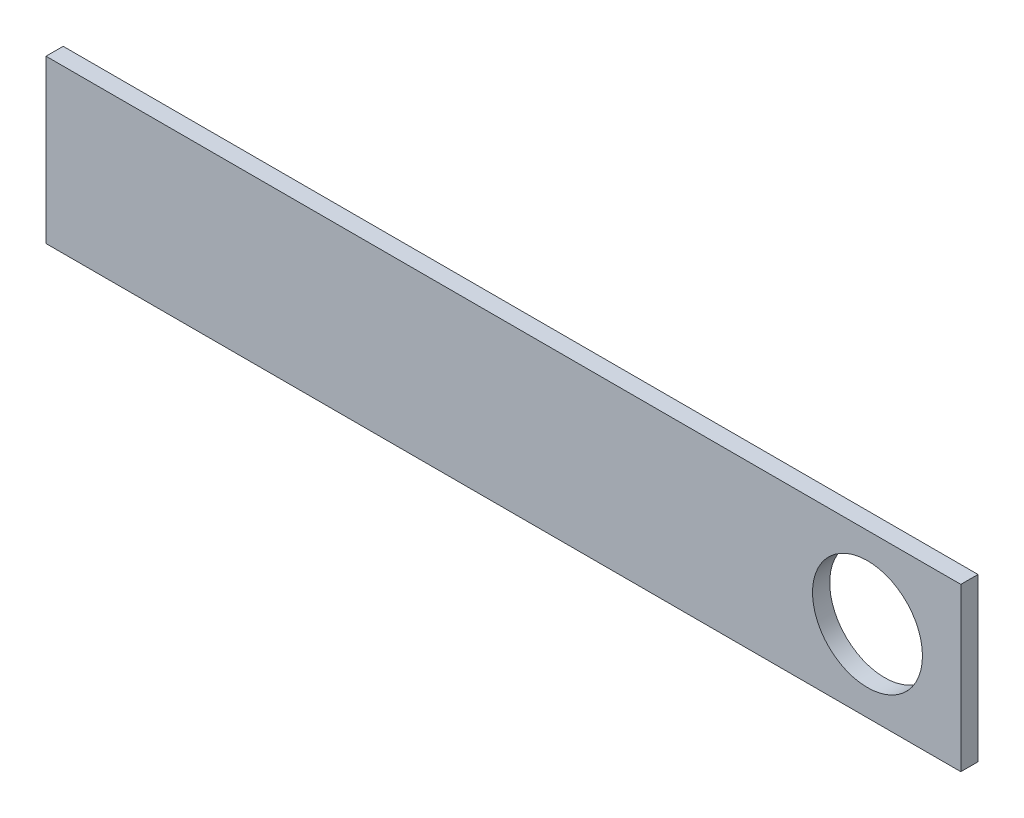
ISO-10303-21;
HEADER;
FILE_DESCRIPTION(('STEP AP214'),'2;1');
FILE_NAME('part.step','',(''),(''),'','','');
FILE_SCHEMA(('AUTOMOTIVE_DESIGN { 1 0 10303 214 1 1 1 1 }'));
ENDSEC;
DATA;
#1=APPLICATION_CONTEXT('core data for automotive mechanical design processes');
#2=APPLICATION_PROTOCOL_DEFINITION('international standard','automotive_design',2000,#1);
#3=PRODUCT_CONTEXT('',#1,'mechanical');
#4=PRODUCT('Part','Part','',(#3));
#5=PRODUCT_RELATED_PRODUCT_CATEGORY('part','',(#4));
#6=PRODUCT_DEFINITION_FORMATION('','',#4);
#7=PRODUCT_DEFINITION_CONTEXT('part definition',#1,'design');
#8=PRODUCT_DEFINITION('design','',#6,#7);
#9=PRODUCT_DEFINITION_SHAPE('','',#8);
#10=(LENGTH_UNIT() NAMED_UNIT(*) SI_UNIT(.MILLI.,.METRE.));
#11=(NAMED_UNIT(*) PLANE_ANGLE_UNIT() SI_UNIT($,.RADIAN.));
#12=(NAMED_UNIT(*) SI_UNIT($,.STERADIAN.) SOLID_ANGLE_UNIT());
#13=UNCERTAINTY_MEASURE_WITH_UNIT(LENGTH_MEASURE(1.E-05),#10,'distance_accuracy_value','');
#14=(GEOMETRIC_REPRESENTATION_CONTEXT(3) GLOBAL_UNCERTAINTY_ASSIGNED_CONTEXT((#13)) GLOBAL_UNIT_ASSIGNED_CONTEXT((#10,
#11,#12)) REPRESENTATION_CONTEXT('',''));
#15=CARTESIAN_POINT('',(0.,0.,0.));
#16=DIRECTION('',(0.,0.,1.));
#17=DIRECTION('',(1.,0.,0.));
#18=AXIS2_PLACEMENT_3D('',#15,#16,#17);
#19=CARTESIAN_POINT('',(-67.8561110498564,-48.7503047618274,-2.54));
#20=DIRECTION('',(-1.,0.,0.));
#21=DIRECTION('',(0.,0.,1.));
#22=AXIS2_PLACEMENT_3D('',#19,#20,#21);
#23=PLANE('',#22);
#24=DIRECTION('',(0.,-1.,0.));
#25=VECTOR('',#24,1.);
#26=CARTESIAN_POINT('',(-67.8561110498564,-48.7503047618274,0.));
#27=LINE('',#26,#25);
#28=CARTESIAN_POINT('',(-67.8561110498564,-48.7503047618274,0.));
#29=VERTEX_POINT('',#28);
#30=CARTESIAN_POINT('',(-67.8561110498564,-72.7506400697544,0.));
#31=VERTEX_POINT('',#30);
#32=EDGE_CURVE('E97',#29,#31,#27,.T.);
#33=ORIENTED_EDGE('',*,*,#32,.F.);
#34=DIRECTION('',(0.,0.,1.));
#35=VECTOR('',#34,1.);
#36=CARTESIAN_POINT('',(-67.8561110498564,-48.7503047618274,-2.54));
#37=LINE('',#36,#35);
#38=CARTESIAN_POINT('',(-67.8561110498564,-48.7503047618274,-2.54));
#39=VERTEX_POINT('',#38);
#40=EDGE_CURVE('E11',#39,#29,#37,.T.);
#41=ORIENTED_EDGE('',*,*,#40,.F.);
#42=DIRECTION('',(0.,-1.,0.));
#43=VECTOR('',#42,1.);
#44=CARTESIAN_POINT('',(-67.8561110498564,-48.7503047618274,-2.54));
#45=LINE('',#44,#43);
#46=CARTESIAN_POINT('',(-67.8561110498564,-72.7506400697544,-2.54));
#47=VERTEX_POINT('',#46);
#48=EDGE_CURVE('E90',#39,#47,#45,.T.);
#49=ORIENTED_EDGE('',*,*,#48,.T.);
#50=DIRECTION('',(0.,0.,1.));
#51=VECTOR('',#50,1.);
#52=CARTESIAN_POINT('',(-67.8561110498564,-72.7506400697544,-2.54));
#53=LINE('',#52,#51);
#54=EDGE_CURVE('E35',#47,#31,#53,.T.);
#55=ORIENTED_EDGE('',*,*,#54,.T.);
#56=EDGE_LOOP('',(#33,#41,#49,#55));
#57=FACE_BOUND('',#56,.T.);
#58=ADVANCED_FACE('F32',(#57),#23,.T.);
#59=CARTESIAN_POINT('',(-67.8561110498564,-48.7503047618274,-2.54));
#60=DIRECTION('',(0.,1.,0.));
#61=DIRECTION('',(0.,0.,1.));
#62=AXIS2_PLACEMENT_3D('',#59,#60,#61);
#63=PLANE('',#62);
#64=DIRECTION('',(-1.,0.,0.));
#65=VECTOR('',#64,1.);
#66=CARTESIAN_POINT('',(-67.8561110498564,-48.7503047618274,0.));
#67=LINE('',#66,#65);
#68=CARTESIAN_POINT('',(67.4652240809156,-48.7503047618274,0.));
#69=VERTEX_POINT('',#68);
#70=EDGE_CURVE('E92',#69,#29,#67,.T.);
#71=ORIENTED_EDGE('',*,*,#70,.F.);
#72=DIRECTION('',(0.,0.,1.));
#73=VECTOR('',#72,1.);
#74=CARTESIAN_POINT('',(67.4652240809156,-48.7503047618274,-2.54));
#75=LINE('',#74,#73);
#76=CARTESIAN_POINT('',(67.4652240809156,-48.7503047618274,-2.54));
#77=VERTEX_POINT('',#76);
#78=EDGE_CURVE('E41',#77,#69,#75,.T.);
#79=ORIENTED_EDGE('',*,*,#78,.F.);
#80=DIRECTION('',(-1.,0.,0.));
#81=VECTOR('',#80,1.);
#82=CARTESIAN_POINT('',(-67.8561110498564,-48.7503047618274,-2.54));
#83=LINE('',#82,#81);
#84=EDGE_CURVE('E87',#77,#39,#83,.T.);
#85=ORIENTED_EDGE('',*,*,#84,.T.);
#86=ORIENTED_EDGE('',*,*,#40,.T.);
#87=EDGE_LOOP('',(#71,#79,#85,#86));
#88=FACE_BOUND('',#87,.T.);
#89=ADVANCED_FACE('F108',(#88),#63,.T.);
#90=CARTESIAN_POINT('',(67.4652240809156,-48.7503047618274,-2.54));
#91=DIRECTION('',(1.,0.,0.));
#92=DIRECTION('',(0.,0.,-1.));
#93=AXIS2_PLACEMENT_3D('',#90,#91,#92);
#94=PLANE('',#93);
#95=DIRECTION('',(0.,1.,0.));
#96=VECTOR('',#95,1.);
#97=CARTESIAN_POINT('',(67.4652240809156,-48.7503047618274,0.));
#98=LINE('',#97,#96);
#99=CARTESIAN_POINT('',(67.4652240809156,-72.7506400697544,0.));
#100=VERTEX_POINT('',#99);
#101=EDGE_CURVE('E82',#100,#69,#98,.T.);
#102=ORIENTED_EDGE('',*,*,#101,.F.);
#103=DIRECTION('',(0.,0.,1.));
#104=VECTOR('',#103,1.);
#105=CARTESIAN_POINT('',(67.4652240809156,-72.7506400697544,-2.54));
#106=LINE('',#105,#104);
#107=CARTESIAN_POINT('',(67.4652240809156,-72.7506400697544,-2.54));
#108=VERTEX_POINT('',#107);
#109=EDGE_CURVE('E77',#108,#100,#106,.T.);
#110=ORIENTED_EDGE('',*,*,#109,.F.);
#111=DIRECTION('',(0.,1.,0.));
#112=VECTOR('',#111,1.);
#113=CARTESIAN_POINT('',(67.4652240809156,-48.7503047618274,-2.54));
#114=LINE('',#113,#112);
#115=EDGE_CURVE('E80',#108,#77,#114,.T.);
#116=ORIENTED_EDGE('',*,*,#115,.T.);
#117=ORIENTED_EDGE('',*,*,#78,.T.);
#118=EDGE_LOOP('',(#102,#110,#116,#117));
#119=FACE_BOUND('',#118,.T.);
#120=ADVANCED_FACE('F79',(#119),#94,.T.);
#121=CARTESIAN_POINT('',(-67.8561110498564,-72.7506400697544,-2.54));
#122=DIRECTION('',(0.,-1.,0.));
#123=DIRECTION('',(0.,0.,-1.));
#124=AXIS2_PLACEMENT_3D('',#121,#122,#123);
#125=PLANE('',#124);
#126=DIRECTION('',(1.,0.,0.));
#127=VECTOR('',#126,1.);
#128=CARTESIAN_POINT('',(-67.8561110498564,-72.7506400697544,0.));
#129=LINE('',#128,#127);
#130=EDGE_CURVE('E100',#31,#100,#129,.T.);
#131=ORIENTED_EDGE('',*,*,#130,.F.);
#132=ORIENTED_EDGE('',*,*,#54,.F.);
#133=DIRECTION('',(1.,0.,0.));
#134=VECTOR('',#133,1.);
#135=CARTESIAN_POINT('',(-67.8561110498564,-72.7506400697544,-2.54));
#136=LINE('',#135,#134);
#137=EDGE_CURVE('E86',#47,#108,#136,.T.);
#138=ORIENTED_EDGE('',*,*,#137,.T.);
#139=ORIENTED_EDGE('',*,*,#109,.T.);
#140=EDGE_LOOP('',(#131,#132,#138,#139));
#141=FACE_BOUND('',#140,.T.);
#142=ADVANCED_FACE('F89',(#141),#125,.T.);
#143=CARTESIAN_POINT('',(0.,0.,-2.54));
#144=DIRECTION('',(0.,0.,1.));
#145=DIRECTION('',(1.,0.,0.));
#146=AXIS2_PLACEMENT_3D('',#143,#144,#145);
#147=PLANE('',#146);
#148=CARTESIAN_POINT('',(53.65930267602,-60.7504724157909,-2.54));
#149=DIRECTION('',(0.,0.,1.));
#150=DIRECTION('',(1.,0.,0.));
#151=AXIS2_PLACEMENT_3D('',#148,#149,#150);
#152=CIRCLE('',#151,8.1301195861903);
#153=CARTESIAN_POINT('',(61.7894222622103,-60.7504724157909,-2.54));
#154=VERTEX_POINT('',#153);
#155=EDGE_CURVE('E101',#154,#154,#152,.T.);
#156=ORIENTED_EDGE('',*,*,#155,.T.);
#157=EDGE_LOOP('',(#156));
#158=FACE_BOUND('',#157,.T.);
#159=ORIENTED_EDGE('',*,*,#48,.F.);
#160=ORIENTED_EDGE('',*,*,#84,.F.);
#161=ORIENTED_EDGE('',*,*,#115,.F.);
#162=ORIENTED_EDGE('',*,*,#137,.F.);
#163=EDGE_LOOP('',(#159,#160,#161,#162));
#164=FACE_BOUND('',#163,.T.);
#165=ADVANCED_FACE('F85',(#158,#164),#147,.F.);
#166=CARTESIAN_POINT('',(0.,0.,0.));
#167=DIRECTION('',(0.,0.,1.));
#168=DIRECTION('',(1.,0.,0.));
#169=AXIS2_PLACEMENT_3D('',#166,#167,#168);
#170=PLANE('',#169);
#171=CARTESIAN_POINT('',(53.65930267602,-60.7504724157909,0.));
#172=DIRECTION('',(0.,0.,1.));
#173=DIRECTION('',(1.,0.,0.));
#174=AXIS2_PLACEMENT_3D('',#171,#172,#173);
#175=CIRCLE('',#174,8.1301195861903);
#176=CARTESIAN_POINT('',(61.7894222622103,-60.7504724157909,0.));
#177=VERTEX_POINT('',#176);
#178=EDGE_CURVE('E138',#177,#177,#175,.T.);
#179=ORIENTED_EDGE('',*,*,#178,.F.);
#180=EDGE_LOOP('',(#179));
#181=FACE_BOUND('',#180,.T.);
#182=ORIENTED_EDGE('',*,*,#32,.T.);
#183=ORIENTED_EDGE('',*,*,#130,.T.);
#184=ORIENTED_EDGE('',*,*,#101,.T.);
#185=ORIENTED_EDGE('',*,*,#70,.T.);
#186=EDGE_LOOP('',(#182,#183,#184,#185));
#187=FACE_BOUND('',#186,.T.);
#188=ADVANCED_FACE('F107',(#181,#187),#170,.T.);
#189=CARTESIAN_POINT('',(53.65930267602,-60.7504724157909,-2.54));
#190=DIRECTION('',(0.,0.,1.));
#191=DIRECTION('',(1.,0.,0.));
#192=AXIS2_PLACEMENT_3D('',#189,#190,#191);
#193=CYLINDRICAL_SURFACE('',#192,8.1301195861903);
#194=ORIENTED_EDGE('',*,*,#155,.F.);
#195=EDGE_LOOP('',(#194));
#196=FACE_BOUND('',#195,.T.);
#197=ORIENTED_EDGE('',*,*,#178,.T.);
#198=EDGE_LOOP('',(#197));
#199=FACE_BOUND('',#198,.T.);
#200=ADVANCED_FACE('F126',(#196,#199),#193,.F.);
#201=CLOSED_SHELL('',(#58,#89,#120,#142,#165,#188,#200));
#202=MANIFOLD_SOLID_BREP('B2',#201);
#203=ADVANCED_BREP_SHAPE_REPRESENTATION('',(#18,#202),#14);
#204=SHAPE_DEFINITION_REPRESENTATION(#9,#203);
ENDSEC;
END-ISO-10303-21;
